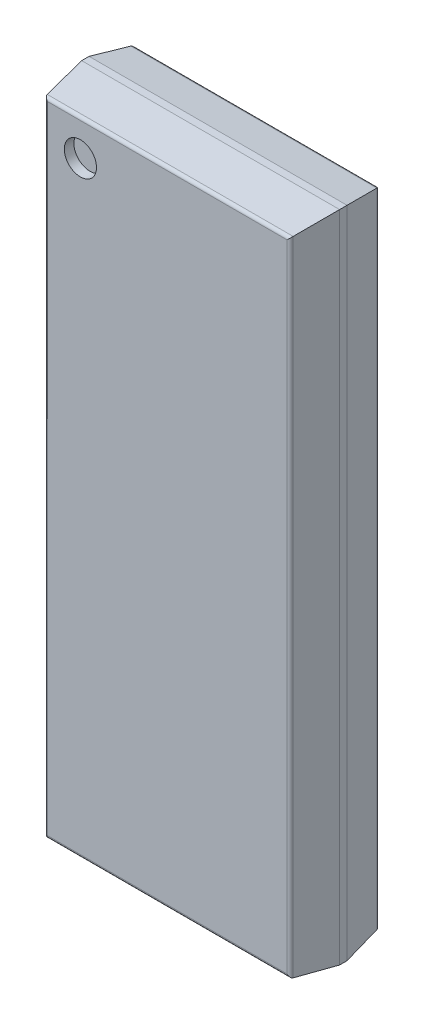
ISO-10303-21;
HEADER;
FILE_DESCRIPTION(('STEP AP214'),'2;1');
FILE_NAME('part.step','',(''),(''),'','','');
FILE_SCHEMA(('AUTOMOTIVE_DESIGN { 1 0 10303 214 1 1 1 1 }'));
ENDSEC;
DATA;
#1=APPLICATION_CONTEXT('core data for automotive mechanical design processes');
#2=APPLICATION_PROTOCOL_DEFINITION('international standard','automotive_design',2000,#1);
#3=PRODUCT_CONTEXT('',#1,'mechanical');
#4=PRODUCT('Part','Part','',(#3));
#5=PRODUCT_RELATED_PRODUCT_CATEGORY('part','',(#4));
#6=PRODUCT_DEFINITION_FORMATION('','',#4);
#7=PRODUCT_DEFINITION_CONTEXT('part definition',#1,'design');
#8=PRODUCT_DEFINITION('design','',#6,#7);
#9=PRODUCT_DEFINITION_SHAPE('','',#8);
#10=(LENGTH_UNIT() NAMED_UNIT(*) SI_UNIT(.MILLI.,.METRE.));
#11=(NAMED_UNIT(*) PLANE_ANGLE_UNIT() SI_UNIT($,.RADIAN.));
#12=(NAMED_UNIT(*) SI_UNIT($,.STERADIAN.) SOLID_ANGLE_UNIT());
#13=UNCERTAINTY_MEASURE_WITH_UNIT(LENGTH_MEASURE(1.E-05),#10,'distance_accuracy_value','');
#14=(GEOMETRIC_REPRESENTATION_CONTEXT(3) GLOBAL_UNCERTAINTY_ASSIGNED_CONTEXT((#13)) GLOBAL_UNIT_ASSIGNED_CONTEXT((#10,
#11,#12)) REPRESENTATION_CONTEXT('',''));
#15=CARTESIAN_POINT('',(0.,0.,0.));
#16=DIRECTION('',(0.,0.,1.));
#17=DIRECTION('',(1.,0.,0.));
#18=AXIS2_PLACEMENT_3D('',#15,#16,#17);
#19=CARTESIAN_POINT('',(-2.82325,7.36125,2.376));
#20=DIRECTION('',(0.,0.,1.));
#21=DIRECTION('',(1.,0.,0.));
#22=AXIS2_PLACEMENT_3D('',#19,#20,#21);
#23=PLANE('',#22);
#24=CARTESIAN_POINT('',(-2.381,7.8035,2.376));
#25=DIRECTION('',(0.,0.,1.));
#26=DIRECTION('',(1.,0.,0.));
#27=AXIS2_PLACEMENT_3D('',#24,#25,#26);
#28=CIRCLE('',#27,0.441249999999999);
#29=CARTESIAN_POINT('',(-1.93975,7.8035,2.376));
#30=VERTEX_POINT('',#29);
#31=EDGE_CURVE('E137',#30,#30,#28,.F.);
#32=ORIENTED_EDGE('',*,*,#31,.F.);
#33=EDGE_LOOP('',(#32));
#34=FACE_BOUND('',#33,.T.);
#35=ADVANCED_FACE('F16',(#34),#23,.T.);
#36=CARTESIAN_POINT('',(3.53100000000064,8.95264758079378,1.45615157215056));
#37=DIRECTION('',(0.,0.989050003478919,0.147580793527988));
#38=DIRECTION('',(-1.,0.,0.));
#39=AXIS2_PLACEMENT_3D('',#36,#37,#38);
#40=PLANE('',#39);
#41=DIRECTION('',(-0.145999417503216,-0.145999417502955,0.978452012199637));
#42=VECTOR('',#41,1.);
#43=CARTESIAN_POINT('',(3.53000000000024,8.95250000000066,1.45714062215413));
#44=LINE('',#43,#42);
#45=CARTESIAN_POINT('',(3.53000000000001,8.95250000000039,1.45714062215556));
#46=VERTEX_POINT('',#45);
#47=CARTESIAN_POINT('',(3.36494741238781,8.78744741238816,2.56328227141727));
#48=VERTEX_POINT('',#47);
#49=EDGE_CURVE('E112',#46,#48,#44,.T.);
#50=ORIENTED_EDGE('',*,*,#49,.F.);
#51=DIRECTION('',(1.,0.,0.));
#52=VECTOR('',#51,1.);
#53=CARTESIAN_POINT('',(0.,8.9525,1.457140622154));
#54=LINE('',#53,#52);
#55=CARTESIAN_POINT('',(-3.53000000000003,8.95250000000014,1.4571406221547));
#56=VERTEX_POINT('',#55);
#57=EDGE_CURVE('E126',#56,#46,#54,.T.);
#58=ORIENTED_EDGE('',*,*,#57,.F.);
#59=DIRECTION('',(0.145999417502953,-0.145999417503219,0.978452012199637));
#60=VECTOR('',#59,1.);
#61=CARTESIAN_POINT('',(-3.53000000000015,8.95250000000025,1.45714062215406));
#62=LINE('',#61,#60);
#63=CARTESIAN_POINT('',(-3.36494741238798,8.78744741238772,2.56328227141698));
#64=VERTEX_POINT('',#63);
#65=EDGE_CURVE('E20',#56,#64,#62,.T.);
#66=ORIENTED_EDGE('',*,*,#65,.T.);
#67=DIRECTION('',(-1.,0.,0.));
#68=VECTOR('',#67,1.);
#69=CARTESIAN_POINT('',(0.,8.78744741238818,2.56328227141703));
#70=LINE('',#69,#68);
#71=EDGE_CURVE('E140',#48,#64,#70,.T.);
#72=ORIENTED_EDGE('',*,*,#71,.F.);
#73=EDGE_LOOP('',(#50,#58,#66,#72));
#74=FACE_BOUND('',#73,.T.);
#75=ADVANCED_FACE('F127',(#74),#40,.T.);
#76=CARTESIAN_POINT('',(3.53014758079378,-8.9535,1.45615157215054));
#77=DIRECTION('',(0.989050003478919,0.,0.147580793527985));
#78=DIRECTION('',(0.,1.,0.));
#79=AXIS2_PLACEMENT_3D('',#76,#77,#78);
#80=PLANE('',#79);
#81=ORIENTED_EDGE('',*,*,#49,.T.);
#82=DIRECTION('',(0.,1.,0.));
#83=VECTOR('',#82,1.);
#84=CARTESIAN_POINT('',(3.36494741238818,0.,2.56328227141703));
#85=LINE('',#84,#83);
#86=CARTESIAN_POINT('',(3.36494741238799,-8.78744741238798,2.563282271417));
#87=VERTEX_POINT('',#86);
#88=EDGE_CURVE('E152',#87,#48,#85,.T.);
#89=ORIENTED_EDGE('',*,*,#88,.F.);
#90=DIRECTION('',(-0.145999417502952,0.145999417503219,0.978452012199637));
#91=VECTOR('',#90,1.);
#92=CARTESIAN_POINT('',(3.52999999999987,-8.95250000000025,1.45714062215402));
#93=LINE('',#92,#91);
#94=CARTESIAN_POINT('',(3.52999999999992,-8.95250000000018,1.45714062215421));
#95=VERTEX_POINT('',#94);
#96=EDGE_CURVE('E203',#95,#87,#93,.T.);
#97=ORIENTED_EDGE('',*,*,#96,.F.);
#98=DIRECTION('',(0.,-1.,0.));
#99=VECTOR('',#98,1.);
#100=CARTESIAN_POINT('',(3.53,0.,1.457140622154));
#101=LINE('',#100,#99);
#102=EDGE_CURVE('E164',#46,#95,#101,.T.);
#103=ORIENTED_EDGE('',*,*,#102,.F.);
#104=EDGE_LOOP('',(#81,#89,#97,#103));
#105=FACE_BOUND('',#104,.T.);
#106=ADVANCED_FACE('F208',(#105),#80,.T.);
#107=CARTESIAN_POINT('',(-3.53100000000034,-8.95264758079378,1.45615157215054));
#108=DIRECTION('',(0.,-0.989050003478919,0.147580793527989));
#109=DIRECTION('',(1.,0.,0.));
#110=AXIS2_PLACEMENT_3D('',#107,#108,#109);
#111=PLANE('',#110);
#112=ORIENTED_EDGE('',*,*,#96,.T.);
#113=DIRECTION('',(1.,0.,0.));
#114=VECTOR('',#113,1.);
#115=CARTESIAN_POINT('',(0.,-8.7874474123881,2.56328227141752));
#116=LINE('',#115,#114);
#117=CARTESIAN_POINT('',(-3.36494741238779,-8.7874474123878,2.56328227141734));
#118=VERTEX_POINT('',#117);
#119=EDGE_CURVE('E157',#118,#87,#116,.T.);
#120=ORIENTED_EDGE('',*,*,#119,.F.);
#121=DIRECTION('',(-0.145999417502952,-0.14599941750322,-0.978452012199637));
#122=VECTOR('',#121,1.);
#123=CARTESIAN_POINT('',(-3.36494741238792,-8.78744741238752,2.56328227141692));
#124=LINE('',#123,#122);
#125=CARTESIAN_POINT('',(-3.53000000000019,-8.95250000000005,1.45714062215503));
#126=VERTEX_POINT('',#125);
#127=EDGE_CURVE('E205',#118,#126,#124,.T.);
#128=ORIENTED_EDGE('',*,*,#127,.T.);
#129=DIRECTION('',(-1.,0.,0.));
#130=VECTOR('',#129,1.);
#131=CARTESIAN_POINT('',(0.,-8.9525,1.457140622154));
#132=LINE('',#131,#130);
#133=EDGE_CURVE('E161',#95,#126,#132,.T.);
#134=ORIENTED_EDGE('',*,*,#133,.F.);
#135=EDGE_LOOP('',(#112,#120,#128,#134));
#136=FACE_BOUND('',#135,.T.);
#137=ADVANCED_FACE('F273',(#136),#111,.T.);
#138=CARTESIAN_POINT('',(3.36494741238846,-8.69843291207526,2.5500000000003));
#139=DIRECTION('',(-1.,0.,0.));
#140=DIRECTION('',(0.,0.,1.));
#141=AXIS2_PLACEMENT_3D('',#138,#139,#140);
#142=CYLINDRICAL_SURFACE('',#141,0.0899999999997034);
#143=CARTESIAN_POINT('',(3.275932912075,-8.69843291207526,2.55000000000015));
#144=DIRECTION('',(-0.707106781186547,-0.707106781186547,0.));
#145=DIRECTION('',(0.707106781186547,-0.707106781186547,0.));
#146=AXIS2_PLACEMENT_3D('',#143,#144,#145);
#147=ELLIPSE('',#146,0.12727922061337,0.0899999999998526);
#148=CARTESIAN_POINT('',(3.27593291207487,-8.69843291207513,2.64));
#149=VERTEX_POINT('',#148);
#150=EDGE_CURVE('E156',#149,#87,#147,.F.);
#151=ORIENTED_EDGE('',*,*,#150,.F.);
#152=DIRECTION('',(1.,0.,0.));
#153=VECTOR('',#152,1.);
#154=CARTESIAN_POINT('',(0.,-8.698432912075,2.64));
#155=LINE('',#154,#153);
#156=CARTESIAN_POINT('',(-3.275932912075,-8.698432912075,2.64));
#157=VERTEX_POINT('',#156);
#158=EDGE_CURVE('E151',#157,#149,#155,.T.);
#159=ORIENTED_EDGE('',*,*,#158,.F.);
#160=CARTESIAN_POINT('',(-3.27593291207525,-8.69843291207526,2.5500000000003));
#161=DIRECTION('',(-0.707106781186547,0.707106781186547,0.));
#162=DIRECTION('',(-0.707106781186547,-0.707106781186547,0.));
#163=AXIS2_PLACEMENT_3D('',#160,#161,#162);
#164=ELLIPSE('',#163,0.127279220613159,0.089999999999703);
#165=EDGE_CURVE('E159',#157,#118,#164,.F.);
#166=ORIENTED_EDGE('',*,*,#165,.T.);
#167=ORIENTED_EDGE('',*,*,#119,.T.);
#168=EDGE_LOOP('',(#151,#159,#166,#167));
#169=FACE_BOUND('',#168,.T.);
#170=ADVANCED_FACE('F271',(#169),#142,.T.);
#171=CARTESIAN_POINT('',(3.275932912075,8.78744741238846,2.55));
#172=DIRECTION('',(0.,-1.,0.));
#173=DIRECTION('',(0.,0.,-1.));
#174=AXIS2_PLACEMENT_3D('',#171,#172,#173);
#175=CYLINDRICAL_SURFACE('',#174,0.0900000000000018);
#176=CARTESIAN_POINT('',(3.275932912075,8.698432912075,2.55));
#177=DIRECTION('',(-0.707106781186547,0.707106781186547,0.));
#178=DIRECTION('',(-0.707106781186547,-0.707106781186547,0.));
#179=AXIS2_PLACEMENT_3D('',#176,#177,#178);
#180=ELLIPSE('',#179,0.127279220613582,0.0900000000000026);
#181=CARTESIAN_POINT('',(3.275932912075,8.698432912075,2.64));
#182=VERTEX_POINT('',#181);
#183=EDGE_CURVE('E146',#182,#48,#180,.T.);
#184=ORIENTED_EDGE('',*,*,#183,.F.);
#185=DIRECTION('',(0.,1.,0.));
#186=VECTOR('',#185,1.);
#187=CARTESIAN_POINT('',(3.275932912075,0.,2.64));
#188=LINE('',#187,#186);
#189=EDGE_CURVE('E147',#149,#182,#188,.T.);
#190=ORIENTED_EDGE('',*,*,#189,.F.);
#191=ORIENTED_EDGE('',*,*,#150,.T.);
#192=ORIENTED_EDGE('',*,*,#88,.T.);
#193=EDGE_LOOP('',(#184,#190,#191,#192));
#194=FACE_BOUND('',#193,.T.);
#195=ADVANCED_FACE('F211',(#194),#175,.T.);
#196=CARTESIAN_POINT('',(3.36494741238846,8.698432912075,2.55));
#197=DIRECTION('',(-1.,0.,0.));
#198=DIRECTION('',(0.,0.,1.));
#199=AXIS2_PLACEMENT_3D('',#196,#197,#198);
#200=CYLINDRICAL_SURFACE('',#199,0.0900000000000034);
#201=ORIENTED_EDGE('',*,*,#183,.T.);
#202=ORIENTED_EDGE('',*,*,#71,.T.);
#203=CARTESIAN_POINT('',(-3.27593291207525,8.698432912075,2.55000000000015));
#204=DIRECTION('',(-0.707106781186547,-0.707106781186547,0.));
#205=DIRECTION('',(-0.707106781186547,0.707106781186547,0.));
#206=AXIS2_PLACEMENT_3D('',#203,#204,#205);
#207=ELLIPSE('',#206,0.127279220613371,0.089999999999853);
#208=CARTESIAN_POINT('',(-3.27593291207513,8.69843291207487,2.64));
#209=VERTEX_POINT('',#208);
#210=EDGE_CURVE('E155',#64,#209,#207,.F.);
#211=ORIENTED_EDGE('',*,*,#210,.T.);
#212=DIRECTION('',(-1.,0.,0.));
#213=VECTOR('',#212,1.);
#214=CARTESIAN_POINT('',(0.,8.698432912075,2.64));
#215=LINE('',#214,#213);
#216=EDGE_CURVE('E150',#182,#209,#215,.T.);
#217=ORIENTED_EDGE('',*,*,#216,.F.);
#218=EDGE_LOOP('',(#201,#202,#211,#217));
#219=FACE_BOUND('',#218,.T.);
#220=ADVANCED_FACE('F215',(#219),#200,.T.);
#221=CARTESIAN_POINT('',(-2.381,7.8035,2.376));
#222=DIRECTION('',(0.,0.,1.));
#223=DIRECTION('',(1.,0.,0.));
#224=AXIS2_PLACEMENT_3D('',#221,#222,#223);
#225=CYLINDRICAL_SURFACE('',#224,0.441249999999999);
#226=CARTESIAN_POINT('',(-2.381,7.8035,2.64));
#227=DIRECTION('',(0.,0.,1.));
#228=DIRECTION('',(1.,0.,0.));
#229=AXIS2_PLACEMENT_3D('',#226,#227,#228);
#230=CIRCLE('',#229,0.441249999999999);
#231=CARTESIAN_POINT('',(-1.93975,7.8035,2.64));
#232=VERTEX_POINT('',#231);
#233=EDGE_CURVE('E193',#232,#232,#230,.F.);
#234=ORIENTED_EDGE('',*,*,#233,.F.);
#235=EDGE_LOOP('',(#234));
#236=FACE_BOUND('',#235,.T.);
#237=ORIENTED_EDGE('',*,*,#31,.T.);
#238=EDGE_LOOP('',(#237));
#239=FACE_BOUND('',#238,.T.);
#240=ADVANCED_FACE('F415',(#236,#239),#225,.F.);
#241=CARTESIAN_POINT('',(-3.531,8.9525,1.253640622154));
#242=DIRECTION('',(0.,1.,0.));
#243=DIRECTION('',(0.,0.,1.));
#244=AXIS2_PLACEMENT_3D('',#241,#242,#243);
#245=PLANE('',#244);
#246=DIRECTION('',(0.,0.,1.));
#247=VECTOR('',#246,1.);
#248=CARTESIAN_POINT('',(-3.53,8.9525,1.355890622154));
#249=LINE('',#248,#247);
#250=CARTESIAN_POINT('',(-3.52999999999963,8.95250000000001,1.25464062215508));
#251=VERTEX_POINT('',#250);
#252=EDGE_CURVE('E118',#251,#56,#249,.T.);
#253=ORIENTED_EDGE('',*,*,#252,.T.);
#254=ORIENTED_EDGE('',*,*,#57,.T.);
#255=DIRECTION('',(0.,0.,1.));
#256=VECTOR('',#255,1.);
#257=CARTESIAN_POINT('',(3.53,8.9525,1.355890622154));
#258=LINE('',#257,#256);
#259=CARTESIAN_POINT('',(3.52999999999995,8.95249999999996,1.25464062215424));
#260=VERTEX_POINT('',#259);
#261=EDGE_CURVE('E130',#260,#46,#258,.T.);
#262=ORIENTED_EDGE('',*,*,#261,.F.);
#263=DIRECTION('',(1.,0.,0.));
#264=VECTOR('',#263,1.);
#265=CARTESIAN_POINT('',(0.,8.9524999999999,1.25464062215402));
#266=LINE('',#265,#264);
#267=EDGE_CURVE('E135',#251,#260,#266,.T.);
#268=ORIENTED_EDGE('',*,*,#267,.F.);
#269=EDGE_LOOP('',(#253,#254,#262,#268));
#270=FACE_BOUND('',#269,.T.);
#271=ADVANCED_FACE('F133',(#270),#245,.T.);
#272=CARTESIAN_POINT('',(3.53,8.9535,1.253640622154));
#273=DIRECTION('',(1.,0.,0.));
#274=DIRECTION('',(0.,0.,1.));
#275=AXIS2_PLACEMENT_3D('',#272,#273,#274);
#276=PLANE('',#275);
#277=ORIENTED_EDGE('',*,*,#261,.T.);
#278=ORIENTED_EDGE('',*,*,#102,.T.);
#279=DIRECTION('',(0.,0.,1.));
#280=VECTOR('',#279,1.);
#281=CARTESIAN_POINT('',(3.53,-8.9525,1.355890622154));
#282=LINE('',#281,#280);
#283=CARTESIAN_POINT('',(3.53,-8.9524999999999,1.25464062215379));
#284=VERTEX_POINT('',#283);
#285=EDGE_CURVE('E163',#284,#95,#282,.T.);
#286=ORIENTED_EDGE('',*,*,#285,.F.);
#287=DIRECTION('',(0.,-1.,0.));
#288=VECTOR('',#287,1.);
#289=CARTESIAN_POINT('',(3.5299999999999,-1.26634813746307E-13,1.25464062215402));
#290=LINE('',#289,#288);
#291=EDGE_CURVE('E187',#260,#284,#290,.T.);
#292=ORIENTED_EDGE('',*,*,#291,.F.);
#293=EDGE_LOOP('',(#277,#278,#286,#292));
#294=FACE_BOUND('',#293,.T.);
#295=ADVANCED_FACE('F239',(#294),#276,.T.);
#296=CARTESIAN_POINT('',(-3.531,-8.9525,1.458140622154));
#297=DIRECTION('',(0.,-1.,0.));
#298=DIRECTION('',(0.,0.,-1.));
#299=AXIS2_PLACEMENT_3D('',#296,#297,#298);
#300=PLANE('',#299);
#301=DIRECTION('',(0.,0.,-1.));
#302=VECTOR('',#301,1.);
#303=CARTESIAN_POINT('',(-3.53,-8.9525,1.355890622154));
#304=LINE('',#303,#302);
#305=CARTESIAN_POINT('',(-3.52999999999983,-8.95249999999997,1.25464062215461));
#306=VERTEX_POINT('',#305);
#307=EDGE_CURVE('E121',#126,#306,#304,.T.);
#308=ORIENTED_EDGE('',*,*,#307,.T.);
#309=DIRECTION('',(-1.,0.,0.));
#310=VECTOR('',#309,1.);
#311=CARTESIAN_POINT('',(1.2490009027033E-13,-8.9524999999999,1.25464062215402));
#312=LINE('',#311,#310);
#313=EDGE_CURVE('E183',#284,#306,#312,.T.);
#314=ORIENTED_EDGE('',*,*,#313,.F.);
#315=ORIENTED_EDGE('',*,*,#285,.T.);
#316=ORIENTED_EDGE('',*,*,#133,.T.);
#317=EDGE_LOOP('',(#308,#314,#315,#316));
#318=FACE_BOUND('',#317,.T.);
#319=ADVANCED_FACE('F276',(#318),#300,.T.);
#320=CARTESIAN_POINT('',(-3.276932912075,-8.699432912075,2.64));
#321=DIRECTION('',(0.,0.,1.));
#322=DIRECTION('',(1.,0.,0.));
#323=AXIS2_PLACEMENT_3D('',#320,#321,#322);
#324=PLANE('',#323);
#325=ORIENTED_EDGE('',*,*,#233,.T.);
#326=EDGE_LOOP('',(#325));
#327=FACE_BOUND('',#326,.T.);
#328=ORIENTED_EDGE('',*,*,#189,.T.);
#329=ORIENTED_EDGE('',*,*,#216,.T.);
#330=DIRECTION('',(0.,1.,0.));
#331=VECTOR('',#330,1.);
#332=CARTESIAN_POINT('',(-3.275932912075,0.,2.64));
#333=LINE('',#332,#331);
#334=EDGE_CURVE('E179',#157,#209,#333,.T.);
#335=ORIENTED_EDGE('',*,*,#334,.F.);
#336=ORIENTED_EDGE('',*,*,#158,.T.);
#337=EDGE_LOOP('',(#328,#329,#335,#336));
#338=FACE_BOUND('',#337,.T.);
#339=ADVANCED_FACE('F223',(#327,#338),#324,.T.);
#340=CARTESIAN_POINT('',(-3.531,8.95266506005663,1.25562690567201));
#341=DIRECTION('',(0.,0.986283517897668,-0.165060056716943));
#342=DIRECTION('',(1.,0.,0.));
#343=AXIS2_PLACEMENT_3D('',#340,#341,#342);
#344=PLANE('',#343);
#345=DIRECTION('',(0.162856467200879,0.162856467200996,0.973116407312948));
#346=VECTOR('',#345,1.);
#347=CARTESIAN_POINT('',(3.36607586776047,8.78857586776041,0.275144594894851));
#348=LINE('',#347,#346);
#349=CARTESIAN_POINT('',(3.36607586776069,8.7885758677606,0.275144594895185));
#350=VERTEX_POINT('',#349);
#351=EDGE_CURVE('E188',#350,#260,#348,.T.);
#352=ORIENTED_EDGE('',*,*,#351,.F.);
#353=DIRECTION('',(1.,0.,0.));
#354=VECTOR('',#353,1.);
#355=CARTESIAN_POINT('',(0.,8.78857586776069,0.275144594894885));
#356=LINE('',#355,#354);
#357=CARTESIAN_POINT('',(-3.36607586776027,8.78857586776078,0.275144594895258));
#358=VERTEX_POINT('',#357);
#359=EDGE_CURVE('E177',#358,#350,#356,.T.);
#360=ORIENTED_EDGE('',*,*,#359,.F.);
#361=DIRECTION('',(-0.162856467200989,0.162856467200872,0.97311640731295));
#362=VECTOR('',#361,1.);
#363=CARTESIAN_POINT('',(-3.36607586775987,8.78857586776049,0.275144594894938));
#364=LINE('',#363,#362);
#365=EDGE_CURVE('E191',#358,#251,#364,.T.);
#366=ORIENTED_EDGE('',*,*,#365,.T.);
#367=ORIENTED_EDGE('',*,*,#267,.T.);
#368=EDGE_LOOP('',(#352,#360,#366,#367));
#369=FACE_BOUND('',#368,.T.);
#370=ADVANCED_FACE('F242',(#369),#344,.T.);
#371=CARTESIAN_POINT('',(3.53016506005662,8.9535,1.25562690567192));
#372=DIRECTION('',(0.986283517897667,0.,-0.165060056716949));
#373=DIRECTION('',(0.,-1.,0.));
#374=AXIS2_PLACEMENT_3D('',#371,#372,#373);
#375=PLANE('',#374);
#376=ORIENTED_EDGE('',*,*,#351,.T.);
#377=ORIENTED_EDGE('',*,*,#291,.T.);
#378=DIRECTION('',(0.16285646720098,-0.162856467200876,0.973116407312952));
#379=VECTOR('',#378,1.);
#380=CARTESIAN_POINT('',(3.36607586776072,-8.78857586776047,0.275144594894802));
#381=LINE('',#380,#379);
#382=CARTESIAN_POINT('',(3.36607586776083,-8.78857586776053,0.275144594895251));
#383=VERTEX_POINT('',#382);
#384=EDGE_CURVE('E180',#383,#284,#381,.T.);
#385=ORIENTED_EDGE('',*,*,#384,.F.);
#386=DIRECTION('',(0.,-1.,0.));
#387=VECTOR('',#386,1.);
#388=CARTESIAN_POINT('',(3.36607586776069,0.,0.275144594894885));
#389=LINE('',#388,#387);
#390=EDGE_CURVE('E173',#350,#383,#389,.T.);
#391=ORIENTED_EDGE('',*,*,#390,.F.);
#392=EDGE_LOOP('',(#376,#377,#385,#391));
#393=FACE_BOUND('',#392,.T.);
#394=ADVANCED_FACE('F278',(#393),#375,.T.);
#395=CARTESIAN_POINT('',(3.53100000000025,-8.95266506005662,1.25562690567196));
#396=DIRECTION('',(0.,-0.986283517897668,-0.165060056716945));
#397=DIRECTION('',(-1.,0.,0.));
#398=AXIS2_PLACEMENT_3D('',#395,#396,#397);
#399=PLANE('',#398);
#400=ORIENTED_EDGE('',*,*,#384,.T.);
#401=ORIENTED_EDGE('',*,*,#313,.T.);
#402=DIRECTION('',(0.162856467200991,0.162856467200874,-0.97311640731295));
#403=VECTOR('',#402,1.);
#404=CARTESIAN_POINT('',(-3.52999999999972,-8.9524999999999,1.25464062215407));
#405=LINE('',#404,#403);
#406=CARTESIAN_POINT('',(-3.36607586776059,-8.78857586776066,0.275144594895353));
#407=VERTEX_POINT('',#406);
#408=EDGE_CURVE('E184',#306,#407,#405,.T.);
#409=ORIENTED_EDGE('',*,*,#408,.T.);
#410=DIRECTION('',(-1.,0.,0.));
#411=VECTOR('',#410,1.);
#412=CARTESIAN_POINT('',(0.,-8.78857586776079,0.275144594895475));
#413=LINE('',#412,#411);
#414=EDGE_CURVE('E170',#383,#407,#413,.T.);
#415=ORIENTED_EDGE('',*,*,#414,.F.);
#416=EDGE_LOOP('',(#400,#401,#409,#415));
#417=FACE_BOUND('',#416,.T.);
#418=ADVANCED_FACE('F295',(#417),#399,.T.);
#419=CARTESIAN_POINT('',(-3.27593291207525,8.78744741238847,2.5500000000003));
#420=DIRECTION('',(0.,-1.,0.));
#421=DIRECTION('',(0.,0.,-1.));
#422=AXIS2_PLACEMENT_3D('',#419,#420,#421);
#423=CYLINDRICAL_SURFACE('',#422,0.0899999999997027);
#424=ORIENTED_EDGE('',*,*,#210,.F.);
#425=DIRECTION('',(0.,1.,0.));
#426=VECTOR('',#425,1.);
#427=CARTESIAN_POINT('',(-3.36494741238752,0.,2.56328227141693));
#428=LINE('',#427,#426);
#429=EDGE_CURVE('E107',#118,#64,#428,.T.);
#430=ORIENTED_EDGE('',*,*,#429,.F.);
#431=ORIENTED_EDGE('',*,*,#165,.F.);
#432=ORIENTED_EDGE('',*,*,#334,.T.);
#433=EDGE_LOOP('',(#424,#430,#431,#432));
#434=FACE_BOUND('',#433,.T.);
#435=ADVANCED_FACE('F269',(#434),#423,.T.);
#436=CARTESIAN_POINT('',(3.36607586776098,8.69981035115,0.289999999999996));
#437=DIRECTION('',(-1.,0.,0.));
#438=DIRECTION('',(0.,0.,1.));
#439=AXIS2_PLACEMENT_3D('',#436,#437,#438);
#440=CYLINDRICAL_SURFACE('',#439,0.0899999999999979);
#441=CARTESIAN_POINT('',(3.27731035115,8.69981035115,0.289999999999997));
#442=DIRECTION('',(0.707106781186547,-0.707106781186547,0.));
#443=DIRECTION('',(-0.707106781186547,-0.707106781186547,0.));
#444=AXIS2_PLACEMENT_3D('',#441,#442,#443);
#445=ELLIPSE('',#444,0.127279220613576,0.0899999999999981);
#446=CARTESIAN_POINT('',(3.27731035115,8.69981035115,0.2));
#447=VERTEX_POINT('',#446);
#448=EDGE_CURVE('E174',#447,#350,#445,.T.);
#449=ORIENTED_EDGE('',*,*,#448,.F.);
#450=DIRECTION('',(1.,0.,0.));
#451=VECTOR('',#450,1.);
#452=CARTESIAN_POINT('',(0.,8.69981035115,0.2));
#453=LINE('',#452,#451);
#454=CARTESIAN_POINT('',(-3.27731035114985,8.69981035115015,0.2));
#455=VERTEX_POINT('',#454);
#456=EDGE_CURVE('E261',#455,#447,#453,.T.);
#457=ORIENTED_EDGE('',*,*,#456,.F.);
#458=CARTESIAN_POINT('',(-3.2773103511497,8.69981035115,0.290000000000174));
#459=DIRECTION('',(-0.707106781186547,-0.707106781186547,0.));
#460=DIRECTION('',(-0.707106781186547,0.707106781186547,0.));
#461=AXIS2_PLACEMENT_3D('',#458,#459,#460);
#462=ELLIPSE('',#461,0.127279220613826,0.0900000000001749);
#463=EDGE_CURVE('E35',#455,#358,#462,.F.);
#464=ORIENTED_EDGE('',*,*,#463,.T.);
#465=ORIENTED_EDGE('',*,*,#359,.T.);
#466=EDGE_LOOP('',(#449,#457,#464,#465));
#467=FACE_BOUND('',#466,.T.);
#468=ADVANCED_FACE('F285',(#467),#440,.T.);
#469=CARTESIAN_POINT('',(3.27731035115,8.78857586776098,0.289999999999999));
#470=DIRECTION('',(0.,-1.,0.));
#471=DIRECTION('',(0.,0.,-1.));
#472=AXIS2_PLACEMENT_3D('',#469,#470,#471);
#473=CYLINDRICAL_SURFACE('',#472,0.0899999999999984);
#474=ORIENTED_EDGE('',*,*,#448,.T.);
#475=ORIENTED_EDGE('',*,*,#390,.T.);
#476=CARTESIAN_POINT('',(3.27731035115,-8.6998103511497,0.290000000000176));
#477=DIRECTION('',(-0.707106781186547,-0.707106781186547,0.));
#478=DIRECTION('',(-0.707106781186547,0.707106781186547,0.));
#479=AXIS2_PLACEMENT_3D('',#476,#477,#478);
#480=ELLIPSE('',#479,0.127279220613827,0.0900000000001758);
#481=CARTESIAN_POINT('',(3.27731035115015,-8.69981035114985,0.2));
#482=VERTEX_POINT('',#481);
#483=EDGE_CURVE('E167',#482,#383,#480,.T.);
#484=ORIENTED_EDGE('',*,*,#483,.F.);
#485=DIRECTION('',(0.,-1.,0.));
#486=VECTOR('',#485,1.);
#487=CARTESIAN_POINT('',(3.27731035115,0.,0.2));
#488=LINE('',#487,#486);
#489=EDGE_CURVE('E259',#447,#482,#488,.T.);
#490=ORIENTED_EDGE('',*,*,#489,.F.);
#491=EDGE_LOOP('',(#474,#475,#484,#490));
#492=FACE_BOUND('',#491,.T.);
#493=ADVANCED_FACE('F283',(#492),#473,.T.);
#494=CARTESIAN_POINT('',(3.36607586776098,-8.6998103511497,0.290000000000353));
#495=DIRECTION('',(-1.,0.,0.));
#496=DIRECTION('',(0.,0.,1.));
#497=AXIS2_PLACEMENT_3D('',#494,#495,#496);
#498=CYLINDRICAL_SURFACE('',#497,0.0900000000003533);
#499=ORIENTED_EDGE('',*,*,#483,.T.);
#500=ORIENTED_EDGE('',*,*,#414,.T.);
#501=CARTESIAN_POINT('',(-3.2773103511497,-8.6998103511497,0.290000000000352));
#502=DIRECTION('',(-0.707106781186547,0.707106781186547,0.));
#503=DIRECTION('',(-0.707106781186547,-0.707106781186547,0.));
#504=AXIS2_PLACEMENT_3D('',#501,#502,#503);
#505=ELLIPSE('',#504,0.127279220614077,0.0900000000003525);
#506=CARTESIAN_POINT('',(-3.27731035115,-8.69981035115,0.2));
#507=VERTEX_POINT('',#506);
#508=EDGE_CURVE('E171',#407,#507,#505,.F.);
#509=ORIENTED_EDGE('',*,*,#508,.T.);
#510=DIRECTION('',(-1.,0.,0.));
#511=VECTOR('',#510,1.);
#512=CARTESIAN_POINT('',(0.,-8.69981035115,0.2));
#513=LINE('',#512,#511);
#514=EDGE_CURVE('E123',#482,#507,#513,.T.);
#515=ORIENTED_EDGE('',*,*,#514,.F.);
#516=EDGE_LOOP('',(#499,#500,#509,#515));
#517=FACE_BOUND('',#516,.T.);
#518=ADVANCED_FACE('F252',(#517),#498,.T.);
#519=CARTESIAN_POINT('',(-3.53014758079378,8.95350000000015,1.45615157215056));
#520=DIRECTION('',(-0.989050003478918,0.,0.147580793527991));
#521=DIRECTION('',(0.,-1.,0.));
#522=AXIS2_PLACEMENT_3D('',#519,#520,#521);
#523=PLANE('',#522);
#524=ORIENTED_EDGE('',*,*,#65,.F.);
#525=DIRECTION('',(0.,1.,0.));
#526=VECTOR('',#525,1.);
#527=CARTESIAN_POINT('',(-3.53,0.,1.457140622154));
#528=LINE('',#527,#526);
#529=EDGE_CURVE('E104',#126,#56,#528,.T.);
#530=ORIENTED_EDGE('',*,*,#529,.F.);
#531=ORIENTED_EDGE('',*,*,#127,.F.);
#532=ORIENTED_EDGE('',*,*,#429,.T.);
#533=EDGE_LOOP('',(#524,#530,#531,#532));
#534=FACE_BOUND('',#533,.T.);
#535=ADVANCED_FACE('F103',(#534),#523,.T.);
#536=CARTESIAN_POINT('',(3.27831035115,-8.70081035115,0.2));
#537=DIRECTION('',(0.,0.,-1.));
#538=DIRECTION('',(-1.,0.,0.));
#539=AXIS2_PLACEMENT_3D('',#536,#537,#538);
#540=PLANE('',#539);
#541=ORIENTED_EDGE('',*,*,#489,.T.);
#542=ORIENTED_EDGE('',*,*,#514,.T.);
#543=DIRECTION('',(0.,-1.,0.));
#544=VECTOR('',#543,1.);
#545=CARTESIAN_POINT('',(-3.27731035115,0.,0.2));
#546=LINE('',#545,#544);
#547=EDGE_CURVE('E122',#455,#507,#546,.T.);
#548=ORIENTED_EDGE('',*,*,#547,.F.);
#549=ORIENTED_EDGE('',*,*,#456,.T.);
#550=EDGE_LOOP('',(#541,#542,#548,#549));
#551=FACE_BOUND('',#550,.T.);
#552=ADVANCED_FACE('F256',(#551),#540,.T.);
#553=CARTESIAN_POINT('',(-3.53,8.9535,1.458140622154));
#554=DIRECTION('',(-1.,0.,0.));
#555=DIRECTION('',(0.,0.,-1.));
#556=AXIS2_PLACEMENT_3D('',#553,#554,#555);
#557=PLANE('',#556);
#558=ORIENTED_EDGE('',*,*,#252,.F.);
#559=DIRECTION('',(0.,1.,0.));
#560=VECTOR('',#559,1.);
#561=CARTESIAN_POINT('',(-3.5299999999999,0.,1.25464062215402));
#562=LINE('',#561,#560);
#563=EDGE_CURVE('E26',#306,#251,#562,.T.);
#564=ORIENTED_EDGE('',*,*,#563,.F.);
#565=ORIENTED_EDGE('',*,*,#307,.F.);
#566=ORIENTED_EDGE('',*,*,#529,.T.);
#567=EDGE_LOOP('',(#558,#564,#565,#566));
#568=FACE_BOUND('',#567,.T.);
#569=ADVANCED_FACE('F115',(#568),#557,.T.);
#570=CARTESIAN_POINT('',(-3.2773103511497,8.78857586776098,0.290000000000352));
#571=DIRECTION('',(0.,-1.,0.));
#572=DIRECTION('',(0.,0.,-1.));
#573=AXIS2_PLACEMENT_3D('',#570,#571,#572);
#574=CYLINDRICAL_SURFACE('',#573,0.0900000000003518);
#575=ORIENTED_EDGE('',*,*,#463,.F.);
#576=ORIENTED_EDGE('',*,*,#547,.T.);
#577=ORIENTED_EDGE('',*,*,#508,.F.);
#578=DIRECTION('',(0.,-1.,0.));
#579=VECTOR('',#578,1.);
#580=CARTESIAN_POINT('',(-3.36607586776049,0.,0.275144594894918));
#581=LINE('',#580,#579);
#582=EDGE_CURVE('E11',#358,#407,#581,.T.);
#583=ORIENTED_EDGE('',*,*,#582,.F.);
#584=EDGE_LOOP('',(#575,#576,#577,#583));
#585=FACE_BOUND('',#584,.T.);
#586=ADVANCED_FACE('F246',(#585),#574,.T.);
#587=CARTESIAN_POINT('',(-3.53016506005663,-8.9535,1.25562690567201));
#588=DIRECTION('',(-0.986283517897669,0.,-0.16506005671694));
#589=DIRECTION('',(0.,1.,0.));
#590=AXIS2_PLACEMENT_3D('',#587,#588,#589);
#591=PLANE('',#590);
#592=ORIENTED_EDGE('',*,*,#365,.F.);
#593=ORIENTED_EDGE('',*,*,#582,.T.);
#594=ORIENTED_EDGE('',*,*,#408,.F.);
#595=ORIENTED_EDGE('',*,*,#563,.T.);
#596=EDGE_LOOP('',(#592,#593,#594,#595));
#597=FACE_BOUND('',#596,.T.);
#598=ADVANCED_FACE('F18',(#597),#591,.T.);
#599=CLOSED_SHELL('',(#35,#75,#106,#137,#170,#195,#220,#240,#271,#295,#319,#339,#370,#394,#418,
#435,#468,#493,#518,#535,#552,#569,#586,#598));
#600=MANIFOLD_SOLID_BREP('B1',#599);
#601=ADVANCED_BREP_SHAPE_REPRESENTATION('',(#18,#600),#14);
#602=SHAPE_DEFINITION_REPRESENTATION(#9,#601);
ENDSEC;
END-ISO-10303-21;
